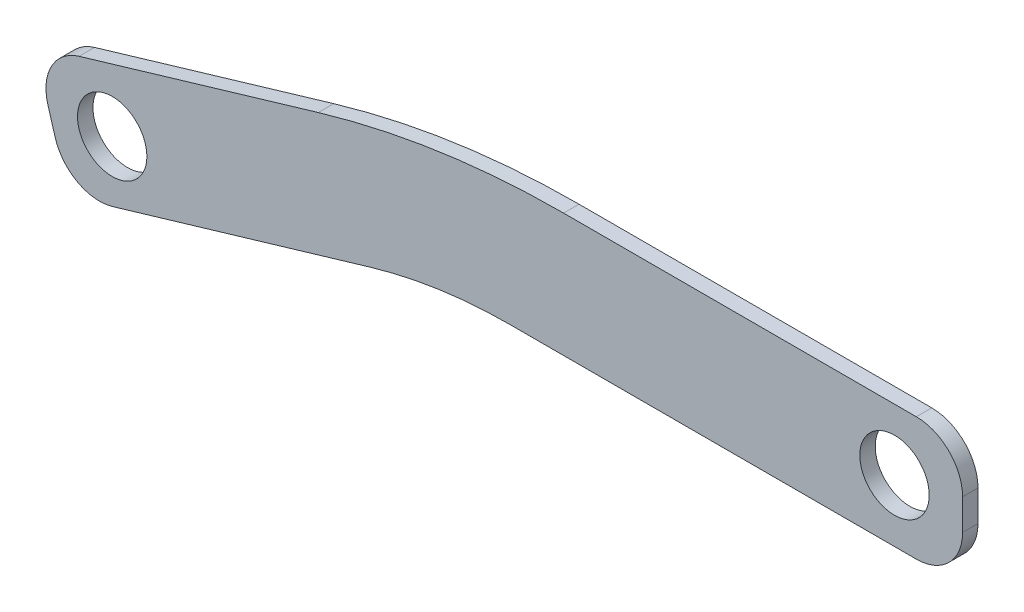
ISO-10303-21;
HEADER;
FILE_DESCRIPTION(('STEP AP214'),'2;1');
FILE_NAME('part.step','',(''),(''),'','','');
FILE_SCHEMA(('AUTOMOTIVE_DESIGN { 1 0 10303 214 1 1 1 1 }'));
ENDSEC;
DATA;
#1=APPLICATION_CONTEXT('core data for automotive mechanical design processes');
#2=APPLICATION_PROTOCOL_DEFINITION('international standard','automotive_design',2000,#1);
#3=PRODUCT_CONTEXT('',#1,'mechanical');
#4=PRODUCT('Part','Part','',(#3));
#5=PRODUCT_RELATED_PRODUCT_CATEGORY('part','',(#4));
#6=PRODUCT_DEFINITION_FORMATION('','',#4);
#7=PRODUCT_DEFINITION_CONTEXT('part definition',#1,'design');
#8=PRODUCT_DEFINITION('design','',#6,#7);
#9=PRODUCT_DEFINITION_SHAPE('','',#8);
#10=(LENGTH_UNIT() NAMED_UNIT(*) SI_UNIT(.MILLI.,.METRE.));
#11=(NAMED_UNIT(*) PLANE_ANGLE_UNIT() SI_UNIT($,.RADIAN.));
#12=(NAMED_UNIT(*) SI_UNIT($,.STERADIAN.) SOLID_ANGLE_UNIT());
#13=UNCERTAINTY_MEASURE_WITH_UNIT(LENGTH_MEASURE(1.E-05),#10,'distance_accuracy_value','');
#14=(GEOMETRIC_REPRESENTATION_CONTEXT(3) GLOBAL_UNCERTAINTY_ASSIGNED_CONTEXT((#13)) GLOBAL_UNIT_ASSIGNED_CONTEXT((#10,
#11,#12)) REPRESENTATION_CONTEXT('',''));
#15=CARTESIAN_POINT('',(0.,0.,0.));
#16=DIRECTION('',(0.,0.,1.));
#17=DIRECTION('',(1.,0.,0.));
#18=AXIS2_PLACEMENT_3D('',#15,#16,#17);
#19=CARTESIAN_POINT('',(0.,0.,6.35));
#20=DIRECTION('',(-0.284088329691374,0.958798112708387,0.));
#21=DIRECTION('',(-0.958798112708387,-0.284088329691374,0.));
#22=AXIS2_PLACEMENT_3D('',#19,#20,#21);
#23=PLANE('',#22);
#24=DIRECTION('',(0.958798112708387,0.284088329691374,0.));
#25=VECTOR('',#24,1.);
#26=CARTESIAN_POINT('',(0.,0.,6.35));
#27=LINE('',#26,#25);
#28=CARTESIAN_POINT('',(-134.134895952905,-39.7436728749349,6.35));
#29=VERTEX_POINT('',#28);
#30=CARTESIAN_POINT('',(-28.2562543045881,-8.37222349765574,6.35));
#31=VERTEX_POINT('',#30);
#32=EDGE_CURVE('E169',#29,#31,#27,.T.);
#33=ORIENTED_EDGE('',*,*,#32,.F.);
#34=DIRECTION('',(0.,0.,-1.));
#35=VECTOR('',#34,1.);
#36=CARTESIAN_POINT('',(-134.134895952905,-39.7436728749349,6.35));
#37=LINE('',#36,#35);
#38=CARTESIAN_POINT('',(-134.134895952905,-39.7436728749349,0.));
#39=VERTEX_POINT('',#38);
#40=EDGE_CURVE('E203',#29,#39,#37,.T.);
#41=ORIENTED_EDGE('',*,*,#40,.T.);
#42=DIRECTION('',(0.958798112708387,0.284088329691374,0.));
#43=VECTOR('',#42,1.);
#44=CARTESIAN_POINT('',(0.,0.,0.));
#45=LINE('',#44,#43);
#46=CARTESIAN_POINT('',(-28.2562543045881,-8.37222349765574,0.));
#47=VERTEX_POINT('',#46);
#48=EDGE_CURVE('E150',#39,#47,#45,.T.);
#49=ORIENTED_EDGE('',*,*,#48,.T.);
#50=DIRECTION('',(0.,0.,-1.));
#51=VECTOR('',#50,1.);
#52=CARTESIAN_POINT('',(-28.2562543045881,-8.37222349765576,6.35));
#53=LINE('',#52,#51);
#54=EDGE_CURVE('E136',#47,#31,#53,.F.);
#55=ORIENTED_EDGE('',*,*,#54,.T.);
#56=EDGE_LOOP('',(#33,#41,#49,#55));
#57=FACE_BOUND('',#56,.T.);
#58=ADVANCED_FACE('F39',(#57),#23,.F.);
#59=CARTESIAN_POINT('',(0.,0.,6.35));
#60=DIRECTION('',(0.,1.,0.));
#61=DIRECTION('',(0.,0.,1.));
#62=AXIS2_PLACEMENT_3D('',#59,#60,#61);
#63=PLANE('',#62);
#64=DIRECTION('',(1.,0.,0.));
#65=VECTOR('',#64,1.);
#66=CARTESIAN_POINT('',(0.,0.,0.));
#67=LINE('',#66,#65);
#68=CARTESIAN_POINT('',(29.4704942886991,0.,0.));
#69=VERTEX_POINT('',#68);
#70=CARTESIAN_POINT('',(196.85,0.,0.));
#71=VERTEX_POINT('',#70);
#72=EDGE_CURVE('E142',#69,#71,#67,.T.);
#73=ORIENTED_EDGE('',*,*,#72,.T.);
#74=DIRECTION('',(0.,0.,-1.));
#75=VECTOR('',#74,1.);
#76=CARTESIAN_POINT('',(196.85,0.,6.35));
#77=LINE('',#76,#75);
#78=CARTESIAN_POINT('',(196.85,0.,6.35));
#79=VERTEX_POINT('',#78);
#80=EDGE_CURVE('E48',#71,#79,#77,.F.);
#81=ORIENTED_EDGE('',*,*,#80,.T.);
#82=DIRECTION('',(1.,0.,0.));
#83=VECTOR('',#82,1.);
#84=CARTESIAN_POINT('',(0.,0.,6.35));
#85=LINE('',#84,#83);
#86=CARTESIAN_POINT('',(29.4704942886991,0.,6.35));
#87=VERTEX_POINT('',#86);
#88=EDGE_CURVE('E143',#87,#79,#85,.T.);
#89=ORIENTED_EDGE('',*,*,#88,.F.);
#90=DIRECTION('',(0.,0.,-1.));
#91=VECTOR('',#90,1.);
#92=CARTESIAN_POINT('',(29.4704942886991,0.,0.));
#93=LINE('',#92,#91);
#94=EDGE_CURVE('E134',#87,#69,#93,.T.);
#95=ORIENTED_EDGE('',*,*,#94,.T.);
#96=EDGE_LOOP('',(#73,#81,#89,#95));
#97=FACE_BOUND('',#96,.T.);
#98=ADVANCED_FACE('F141',(#97),#63,.F.);
#99=CARTESIAN_POINT('',(215.9,0.,6.35));
#100=DIRECTION('',(-1.,0.,0.));
#101=DIRECTION('',(0.,0.,1.));
#102=AXIS2_PLACEMENT_3D('',#99,#100,#101);
#103=PLANE('',#102);
#104=DIRECTION('',(0.,1.,0.));
#105=VECTOR('',#104,1.);
#106=CARTESIAN_POINT('',(215.9,0.,6.35));
#107=LINE('',#106,#105);
#108=CARTESIAN_POINT('',(215.9,19.05,6.35));
#109=VERTEX_POINT('',#108);
#110=CARTESIAN_POINT('',(215.9,31.75,6.35));
#111=VERTEX_POINT('',#110);
#112=EDGE_CURVE('E246',#109,#111,#107,.T.);
#113=ORIENTED_EDGE('',*,*,#112,.F.);
#114=DIRECTION('',(0.,0.,-1.));
#115=VECTOR('',#114,1.);
#116=CARTESIAN_POINT('',(215.9,19.05,6.35));
#117=LINE('',#116,#115);
#118=CARTESIAN_POINT('',(215.9,19.05,0.));
#119=VERTEX_POINT('',#118);
#120=EDGE_CURVE('E231',#109,#119,#117,.T.);
#121=ORIENTED_EDGE('',*,*,#120,.T.);
#122=DIRECTION('',(0.,1.,0.));
#123=VECTOR('',#122,1.);
#124=CARTESIAN_POINT('',(215.9,0.,0.));
#125=LINE('',#124,#123);
#126=CARTESIAN_POINT('',(215.9,31.75,0.));
#127=VERTEX_POINT('',#126);
#128=EDGE_CURVE('E149',#119,#127,#125,.T.);
#129=ORIENTED_EDGE('',*,*,#128,.T.);
#130=DIRECTION('',(0.,0.,-1.));
#131=VECTOR('',#130,1.);
#132=CARTESIAN_POINT('',(215.9,31.75,6.35));
#133=LINE('',#132,#131);
#134=EDGE_CURVE('E224',#127,#111,#133,.F.);
#135=ORIENTED_EDGE('',*,*,#134,.T.);
#136=EDGE_LOOP('',(#113,#121,#129,#135));
#137=FACE_BOUND('',#136,.T.);
#138=ADVANCED_FACE('F292',(#137),#103,.F.);
#139=CARTESIAN_POINT('',(215.9,50.8,6.35));
#140=DIRECTION('',(0.,-1.,0.));
#141=DIRECTION('',(1.,0.,0.));
#142=AXIS2_PLACEMENT_3D('',#139,#140,#141);
#143=PLANE('',#142);
#144=DIRECTION('',(-1.,0.,0.));
#145=VECTOR('',#144,1.);
#146=CARTESIAN_POINT('',(215.9,50.8,6.35));
#147=LINE('',#146,#145);
#148=CARTESIAN_POINT('',(196.85,50.8,6.35));
#149=VERTEX_POINT('',#148);
#150=CARTESIAN_POINT('',(51.5733650052233,50.8,6.35));
#151=VERTEX_POINT('',#150);
#152=EDGE_CURVE('E243',#149,#151,#147,.T.);
#153=ORIENTED_EDGE('',*,*,#152,.F.);
#154=DIRECTION('',(0.,0.,-1.));
#155=VECTOR('',#154,1.);
#156=CARTESIAN_POINT('',(196.85,50.8,6.35));
#157=LINE('',#156,#155);
#158=CARTESIAN_POINT('',(196.85,50.8,0.));
#159=VERTEX_POINT('',#158);
#160=EDGE_CURVE('E216',#149,#159,#157,.T.);
#161=ORIENTED_EDGE('',*,*,#160,.T.);
#162=DIRECTION('',(-1.,0.,0.));
#163=VECTOR('',#162,1.);
#164=CARTESIAN_POINT('',(215.9,50.8,0.));
#165=LINE('',#164,#163);
#166=CARTESIAN_POINT('',(51.5733650052233,50.8,0.));
#167=VERTEX_POINT('',#166);
#168=EDGE_CURVE('E154',#159,#167,#165,.T.);
#169=ORIENTED_EDGE('',*,*,#168,.T.);
#170=DIRECTION('',(0.,0.,-1.));
#171=VECTOR('',#170,1.);
#172=CARTESIAN_POINT('',(51.5733650052233,50.8,6.35));
#173=LINE('',#172,#171);
#174=EDGE_CURVE('E183',#167,#151,#173,.F.);
#175=ORIENTED_EDGE('',*,*,#174,.T.);
#176=EDGE_LOOP('',(#153,#161,#169,#175));
#177=FACE_BOUND('',#176,.T.);
#178=ADVANCED_FACE('F301',(#177),#143,.F.);
#179=CARTESIAN_POINT('',(0.,50.8,6.35));
#180=DIRECTION('',(0.284088329691374,-0.958798112708387,0.));
#181=DIRECTION('',(0.958798112708387,0.284088329691374,0.));
#182=AXIS2_PLACEMENT_3D('',#179,#180,#181);
#183=PLANE('',#182);
#184=DIRECTION('',(-0.958798112708387,-0.284088329691374,0.));
#185=VECTOR('',#184,1.);
#186=CARTESIAN_POINT('',(0.,50.8,0.));
#187=LINE('',#186,#185);
#188=CARTESIAN_POINT('',(-49.4484450330293,36.1486088791025,0.));
#189=VERTEX_POINT('',#188);
#190=CARTESIAN_POINT('',(-147.971970353914,6.95645322846994,0.));
#191=VERTEX_POINT('',#190);
#192=EDGE_CURVE('E162',#189,#191,#187,.T.);
#193=ORIENTED_EDGE('',*,*,#192,.T.);
#194=DIRECTION('',(0.,0.,-1.));
#195=VECTOR('',#194,1.);
#196=CARTESIAN_POINT('',(-147.971970353914,6.95645322846993,6.35));
#197=LINE('',#196,#195);
#198=CARTESIAN_POINT('',(-147.971970353914,6.95645322846994,6.35));
#199=VERTEX_POINT('',#198);
#200=EDGE_CURVE('E197',#191,#199,#197,.F.);
#201=ORIENTED_EDGE('',*,*,#200,.T.);
#202=DIRECTION('',(-0.958798112708387,-0.284088329691374,0.));
#203=VECTOR('',#202,1.);
#204=CARTESIAN_POINT('',(0.,50.8,6.35));
#205=LINE('',#204,#203);
#206=CARTESIAN_POINT('',(-49.4484450330293,36.1486088791025,6.35));
#207=VERTEX_POINT('',#206);
#208=EDGE_CURVE('E240',#207,#199,#205,.T.);
#209=ORIENTED_EDGE('',*,*,#208,.F.);
#210=DIRECTION('',(0.,0.,-1.));
#211=VECTOR('',#210,1.);
#212=CARTESIAN_POINT('',(-49.4484450330293,36.1486088791025,6.35));
#213=LINE('',#212,#211);
#214=EDGE_CURVE('E175',#207,#189,#213,.T.);
#215=ORIENTED_EDGE('',*,*,#214,.T.);
#216=EDGE_LOOP('',(#193,#201,#209,#215));
#217=FACE_BOUND('',#216,.T.);
#218=ADVANCED_FACE('F310',(#217),#183,.F.);
#219=CARTESIAN_POINT('',(-166.237074401009,1.54457054784925,6.35));
#220=DIRECTION('',(0.958798112708387,0.284088329691375,0.));
#221=DIRECTION('',(-0.284088329691375,0.958798112708387,0.));
#222=AXIS2_PLACEMENT_3D('',#219,#220,#221);
#223=PLANE('',#222);
#224=DIRECTION('',(0.284088329691375,-0.958798112708387,0.));
#225=VECTOR('',#224,1.);
#226=CARTESIAN_POINT('',(-166.237074401009,1.54457054784925,0.));
#227=LINE('',#226,#225);
#228=CARTESIAN_POINT('',(-160.825191720388,-16.7205334992455,0.));
#229=VERTEX_POINT('',#228);
#230=CARTESIAN_POINT('',(-157.811882680621,-26.8904515084608,0.));
#231=VERTEX_POINT('',#230);
#232=EDGE_CURVE('E166',#229,#231,#227,.T.);
#233=ORIENTED_EDGE('',*,*,#232,.T.);
#234=DIRECTION('',(0.,0.,-1.));
#235=VECTOR('',#234,1.);
#236=CARTESIAN_POINT('',(-157.811882680621,-26.8904515084608,6.35));
#237=LINE('',#236,#235);
#238=CARTESIAN_POINT('',(-157.811882680621,-26.8904515084608,6.35));
#239=VERTEX_POINT('',#238);
#240=EDGE_CURVE('E210',#231,#239,#237,.F.);
#241=ORIENTED_EDGE('',*,*,#240,.T.);
#242=DIRECTION('',(0.284088329691375,-0.958798112708387,0.));
#243=VECTOR('',#242,1.);
#244=CARTESIAN_POINT('',(-166.237074401009,1.54457054784925,6.35));
#245=LINE('',#244,#243);
#246=CARTESIAN_POINT('',(-160.825191720388,-16.7205334992455,6.35));
#247=VERTEX_POINT('',#246);
#248=EDGE_CURVE('E145',#247,#239,#245,.T.);
#249=ORIENTED_EDGE('',*,*,#248,.F.);
#250=DIRECTION('',(0.,0.,-1.));
#251=VECTOR('',#250,1.);
#252=CARTESIAN_POINT('',(-160.825191720388,-16.7205334992455,6.35));
#253=LINE('',#252,#251);
#254=EDGE_CURVE('E190',#247,#229,#253,.T.);
#255=ORIENTED_EDGE('',*,*,#254,.T.);
#256=EDGE_LOOP('',(#233,#241,#249,#255));
#257=FACE_BOUND('',#256,.T.);
#258=ADVANCED_FACE('F284',(#257),#223,.F.);
#259=CARTESIAN_POINT('',(0.,0.,6.35));
#260=DIRECTION('',(0.,0.,1.));
#261=DIRECTION('',(1.,0.,0.));
#262=AXIS2_PLACEMENT_3D('',#259,#260,#261);
#263=PLANE('',#262);
#264=CARTESIAN_POINT('',(-134.33022137999,-14.825444285993,6.35));
#265=DIRECTION('',(0.,0.,1.));
#266=DIRECTION('',(1.,0.,0.));
#267=AXIS2_PLACEMENT_3D('',#264,#265,#266);
#268=CIRCLE('',#267,14.2875);
#269=CARTESIAN_POINT('',(-120.04272137999,-14.825444285993,6.35));
#270=VERTEX_POINT('',#269);
#271=EDGE_CURVE('E264',#270,#270,#268,.T.);
#272=ORIENTED_EDGE('',*,*,#271,.F.);
#273=EDGE_LOOP('',(#272));
#274=FACE_BOUND('',#273,.T.);
#275=CARTESIAN_POINT('',(187.85890106728,25.4485206278545,6.35));
#276=DIRECTION('',(0.,0.,1.));
#277=DIRECTION('',(1.,0.,0.));
#278=AXIS2_PLACEMENT_3D('',#275,#276,#277);
#279=CIRCLE('',#278,14.2875);
#280=CARTESIAN_POINT('',(202.14640106728,25.4485206278545,6.35));
#281=VERTEX_POINT('',#280);
#282=EDGE_CURVE('E256',#281,#281,#279,.T.);
#283=ORIENTED_EDGE('',*,*,#282,.F.);
#284=EDGE_LOOP('',(#283));
#285=FACE_BOUND('',#284,.T.);
#286=ORIENTED_EDGE('',*,*,#88,.T.);
#287=CARTESIAN_POINT('',(196.85,19.05,6.35));
#288=DIRECTION('',(0.,0.,1.));
#289=DIRECTION('',(1.,0.,0.));
#290=AXIS2_PLACEMENT_3D('',#287,#288,#289);
#291=CIRCLE('',#290,19.05);
#292=EDGE_CURVE('E11',#79,#109,#291,.T.);
#293=ORIENTED_EDGE('',*,*,#292,.T.);
#294=ORIENTED_EDGE('',*,*,#112,.T.);
#295=CARTESIAN_POINT('',(196.85,31.75,6.35));
#296=DIRECTION('',(0.,0.,1.));
#297=DIRECTION('',(1.,0.,0.));
#298=AXIS2_PLACEMENT_3D('',#295,#296,#297);
#299=CIRCLE('',#298,19.05);
#300=EDGE_CURVE('E228',#111,#149,#299,.T.);
#301=ORIENTED_EDGE('',*,*,#300,.T.);
#302=ORIENTED_EDGE('',*,*,#152,.T.);
#303=CARTESIAN_POINT('',(51.5733650052233,-304.8,6.35));
#304=DIRECTION('',(0.,0.,1.));
#305=DIRECTION('',(1.,0.,0.));
#306=AXIS2_PLACEMENT_3D('',#303,#304,#305);
#307=CIRCLE('',#306,355.6);
#308=EDGE_CURVE('E187',#151,#207,#307,.T.);
#309=ORIENTED_EDGE('',*,*,#308,.T.);
#310=ORIENTED_EDGE('',*,*,#208,.T.);
#311=CARTESIAN_POINT('',(-142.560087673293,-11.3086508186248,6.35));
#312=DIRECTION('',(0.,0.,1.));
#313=DIRECTION('',(1.,0.,0.));
#314=AXIS2_PLACEMENT_3D('',#311,#312,#313);
#315=CIRCLE('',#314,19.05);
#316=EDGE_CURVE('E200',#199,#247,#315,.T.);
#317=ORIENTED_EDGE('',*,*,#316,.T.);
#318=ORIENTED_EDGE('',*,*,#248,.T.);
#319=CARTESIAN_POINT('',(-139.546778633526,-21.4785688278401,6.35));
#320=DIRECTION('',(0.,0.,1.));
#321=DIRECTION('',(1.,0.,0.));
#322=AXIS2_PLACEMENT_3D('',#319,#320,#321);
#323=CIRCLE('',#322,19.05);
#324=EDGE_CURVE('E213',#239,#29,#323,.T.);
#325=ORIENTED_EDGE('',*,*,#324,.T.);
#326=ORIENTED_EDGE('',*,*,#32,.T.);
#327=CARTESIAN_POINT('',(29.4704942886991,-203.2,6.35));
#328=DIRECTION('',(0.,0.,1.));
#329=DIRECTION('',(1.,0.,0.));
#330=AXIS2_PLACEMENT_3D('',#327,#328,#329);
#331=CIRCLE('',#330,203.2);
#332=EDGE_CURVE('E139',#31,#87,#331,.F.);
#333=ORIENTED_EDGE('',*,*,#332,.T.);
#334=EDGE_LOOP('',(#286,#293,#294,#301,#302,#309,#310,#317,#318,#325,#326,#333));
#335=FACE_BOUND('',#334,.T.);
#336=ADVANCED_FACE('F281',(#274,#285,#335),#263,.T.);
#337=CARTESIAN_POINT('',(0.,0.,0.));
#338=DIRECTION('',(0.,0.,1.));
#339=DIRECTION('',(1.,0.,0.));
#340=AXIS2_PLACEMENT_3D('',#337,#338,#339);
#341=PLANE('',#340);
#342=CARTESIAN_POINT('',(-134.33022137999,-14.825444285993,0.));
#343=DIRECTION('',(0.,0.,1.));
#344=DIRECTION('',(1.,0.,0.));
#345=AXIS2_PLACEMENT_3D('',#342,#343,#344);
#346=CIRCLE('',#345,14.2875);
#347=CARTESIAN_POINT('',(-120.04272137999,-14.825444285993,0.));
#348=VERTEX_POINT('',#347);
#349=EDGE_CURVE('E156',#348,#348,#346,.T.);
#350=ORIENTED_EDGE('',*,*,#349,.T.);
#351=EDGE_LOOP('',(#350));
#352=FACE_BOUND('',#351,.T.);
#353=CARTESIAN_POINT('',(187.85890106728,25.4485206278545,0.));
#354=DIRECTION('',(0.,0.,1.));
#355=DIRECTION('',(1.,0.,0.));
#356=AXIS2_PLACEMENT_3D('',#353,#354,#355);
#357=CIRCLE('',#356,14.2875);
#358=CARTESIAN_POINT('',(202.14640106728,25.4485206278545,0.));
#359=VERTEX_POINT('',#358);
#360=EDGE_CURVE('E260',#359,#359,#357,.T.);
#361=ORIENTED_EDGE('',*,*,#360,.T.);
#362=EDGE_LOOP('',(#361));
#363=FACE_BOUND('',#362,.T.);
#364=ORIENTED_EDGE('',*,*,#128,.F.);
#365=CARTESIAN_POINT('',(196.85,19.05,0.));
#366=DIRECTION('',(0.,0.,1.));
#367=DIRECTION('',(1.,0.,0.));
#368=AXIS2_PLACEMENT_3D('',#365,#366,#367);
#369=CIRCLE('',#368,19.05);
#370=EDGE_CURVE('E62',#119,#71,#369,.F.);
#371=ORIENTED_EDGE('',*,*,#370,.T.);
#372=ORIENTED_EDGE('',*,*,#72,.F.);
#373=CARTESIAN_POINT('',(29.4704942886991,-203.2,0.));
#374=DIRECTION('',(0.,0.,1.));
#375=DIRECTION('',(1.,0.,0.));
#376=AXIS2_PLACEMENT_3D('',#373,#374,#375);
#377=CIRCLE('',#376,203.2);
#378=EDGE_CURVE('E130',#69,#47,#377,.T.);
#379=ORIENTED_EDGE('',*,*,#378,.T.);
#380=ORIENTED_EDGE('',*,*,#48,.F.);
#381=CARTESIAN_POINT('',(-139.546778633526,-21.4785688278401,0.));
#382=DIRECTION('',(0.,0.,1.));
#383=DIRECTION('',(1.,0.,0.));
#384=AXIS2_PLACEMENT_3D('',#381,#382,#383);
#385=CIRCLE('',#384,19.05);
#386=EDGE_CURVE('E207',#39,#231,#385,.F.);
#387=ORIENTED_EDGE('',*,*,#386,.T.);
#388=ORIENTED_EDGE('',*,*,#232,.F.);
#389=CARTESIAN_POINT('',(-142.560087673293,-11.3086508186248,0.));
#390=DIRECTION('',(0.,0.,1.));
#391=DIRECTION('',(1.,0.,0.));
#392=AXIS2_PLACEMENT_3D('',#389,#390,#391);
#393=CIRCLE('',#392,19.05);
#394=EDGE_CURVE('E194',#229,#191,#393,.F.);
#395=ORIENTED_EDGE('',*,*,#394,.T.);
#396=ORIENTED_EDGE('',*,*,#192,.F.);
#397=CARTESIAN_POINT('',(51.5733650052233,-304.8,0.));
#398=DIRECTION('',(0.,0.,1.));
#399=DIRECTION('',(1.,0.,0.));
#400=AXIS2_PLACEMENT_3D('',#397,#398,#399);
#401=CIRCLE('',#400,355.6);
#402=EDGE_CURVE('E179',#189,#167,#401,.F.);
#403=ORIENTED_EDGE('',*,*,#402,.T.);
#404=ORIENTED_EDGE('',*,*,#168,.F.);
#405=CARTESIAN_POINT('',(196.85,31.75,0.));
#406=DIRECTION('',(0.,0.,1.));
#407=DIRECTION('',(1.,0.,0.));
#408=AXIS2_PLACEMENT_3D('',#405,#406,#407);
#409=CIRCLE('',#408,19.05);
#410=EDGE_CURVE('E220',#159,#127,#409,.F.);
#411=ORIENTED_EDGE('',*,*,#410,.T.);
#412=EDGE_LOOP('',(#364,#371,#372,#379,#380,#387,#388,#395,#396,#403,#404,#411));
#413=FACE_BOUND('',#412,.T.);
#414=ADVANCED_FACE('F147',(#352,#363,#413),#341,.F.);
#415=CARTESIAN_POINT('',(29.4704942886991,-203.2,6.35));
#416=DIRECTION('',(0.,0.,1.));
#417=DIRECTION('',(1.,0.,0.));
#418=AXIS2_PLACEMENT_3D('',#415,#416,#417);
#419=CYLINDRICAL_SURFACE('',#418,203.2);
#420=ORIENTED_EDGE('',*,*,#332,.F.);
#421=ORIENTED_EDGE('',*,*,#54,.F.);
#422=ORIENTED_EDGE('',*,*,#378,.F.);
#423=ORIENTED_EDGE('',*,*,#94,.F.);
#424=EDGE_LOOP('',(#420,#421,#422,#423));
#425=FACE_BOUND('',#424,.T.);
#426=ADVANCED_FACE('F133',(#425),#419,.F.);
#427=CARTESIAN_POINT('',(51.5733650052233,-304.8,6.35));
#428=DIRECTION('',(0.,0.,-1.));
#429=DIRECTION('',(-1.,0.,0.));
#430=AXIS2_PLACEMENT_3D('',#427,#428,#429);
#431=CYLINDRICAL_SURFACE('',#430,355.6);
#432=ORIENTED_EDGE('',*,*,#308,.F.);
#433=ORIENTED_EDGE('',*,*,#174,.F.);
#434=ORIENTED_EDGE('',*,*,#402,.F.);
#435=ORIENTED_EDGE('',*,*,#214,.F.);
#436=EDGE_LOOP('',(#432,#433,#434,#435));
#437=FACE_BOUND('',#436,.T.);
#438=ADVANCED_FACE('F306',(#437),#431,.T.);
#439=CARTESIAN_POINT('',(-142.560087673293,-11.3086508186248,6.35));
#440=DIRECTION('',(0.,0.,-1.));
#441=DIRECTION('',(-1.,0.,0.));
#442=AXIS2_PLACEMENT_3D('',#439,#440,#441);
#443=CYLINDRICAL_SURFACE('',#442,19.05);
#444=ORIENTED_EDGE('',*,*,#316,.F.);
#445=ORIENTED_EDGE('',*,*,#200,.F.);
#446=ORIENTED_EDGE('',*,*,#394,.F.);
#447=ORIENTED_EDGE('',*,*,#254,.F.);
#448=EDGE_LOOP('',(#444,#445,#446,#447));
#449=FACE_BOUND('',#448,.T.);
#450=ADVANCED_FACE('F314',(#449),#443,.T.);
#451=CARTESIAN_POINT('',(-139.546778633526,-21.4785688278401,6.35));
#452=DIRECTION('',(0.,0.,-1.));
#453=DIRECTION('',(-1.,0.,0.));
#454=AXIS2_PLACEMENT_3D('',#451,#452,#453);
#455=CYLINDRICAL_SURFACE('',#454,19.05);
#456=ORIENTED_EDGE('',*,*,#324,.F.);
#457=ORIENTED_EDGE('',*,*,#240,.F.);
#458=ORIENTED_EDGE('',*,*,#386,.F.);
#459=ORIENTED_EDGE('',*,*,#40,.F.);
#460=EDGE_LOOP('',(#456,#457,#458,#459));
#461=FACE_BOUND('',#460,.T.);
#462=ADVANCED_FACE('F322',(#461),#455,.T.);
#463=CARTESIAN_POINT('',(196.85,31.75,6.35));
#464=DIRECTION('',(0.,0.,-1.));
#465=DIRECTION('',(-1.,0.,0.));
#466=AXIS2_PLACEMENT_3D('',#463,#464,#465);
#467=CYLINDRICAL_SURFACE('',#466,19.05);
#468=ORIENTED_EDGE('',*,*,#300,.F.);
#469=ORIENTED_EDGE('',*,*,#134,.F.);
#470=ORIENTED_EDGE('',*,*,#410,.F.);
#471=ORIENTED_EDGE('',*,*,#160,.F.);
#472=EDGE_LOOP('',(#468,#469,#470,#471));
#473=FACE_BOUND('',#472,.T.);
#474=ADVANCED_FACE('F298',(#473),#467,.T.);
#475=CARTESIAN_POINT('',(196.85,19.05,6.35));
#476=DIRECTION('',(0.,0.,-1.));
#477=DIRECTION('',(-1.,0.,0.));
#478=AXIS2_PLACEMENT_3D('',#475,#476,#477);
#479=CYLINDRICAL_SURFACE('',#478,19.05);
#480=ORIENTED_EDGE('',*,*,#292,.F.);
#481=ORIENTED_EDGE('',*,*,#80,.F.);
#482=ORIENTED_EDGE('',*,*,#370,.F.);
#483=ORIENTED_EDGE('',*,*,#120,.F.);
#484=EDGE_LOOP('',(#480,#481,#482,#483));
#485=FACE_BOUND('',#484,.T.);
#486=ADVANCED_FACE('F41',(#485),#479,.T.);
#487=CARTESIAN_POINT('',(187.85890106728,25.4485206278545,0.));
#488=DIRECTION('',(0.,0.,1.));
#489=DIRECTION('',(1.,0.,0.));
#490=AXIS2_PLACEMENT_3D('',#487,#488,#489);
#491=CYLINDRICAL_SURFACE('',#490,14.2875);
#492=ORIENTED_EDGE('',*,*,#360,.F.);
#493=EDGE_LOOP('',(#492));
#494=FACE_BOUND('',#493,.T.);
#495=ORIENTED_EDGE('',*,*,#282,.T.);
#496=EDGE_LOOP('',(#495));
#497=FACE_BOUND('',#496,.T.);
#498=ADVANCED_FACE('F277',(#494,#497),#491,.F.);
#499=CARTESIAN_POINT('',(-134.33022137999,-14.825444285993,0.));
#500=DIRECTION('',(0.,0.,1.));
#501=DIRECTION('',(1.,0.,0.));
#502=AXIS2_PLACEMENT_3D('',#499,#500,#501);
#503=CYLINDRICAL_SURFACE('',#502,14.2875);
#504=ORIENTED_EDGE('',*,*,#349,.F.);
#505=EDGE_LOOP('',(#504));
#506=FACE_BOUND('',#505,.T.);
#507=ORIENTED_EDGE('',*,*,#271,.T.);
#508=EDGE_LOOP('',(#507));
#509=FACE_BOUND('',#508,.T.);
#510=ADVANCED_FACE('F274',(#506,#509),#503,.F.);
#511=CLOSED_SHELL('',(#58,#98,#138,#178,#218,#258,#336,#414,#426,#438,#450,#462,#474,#486,#498,#510));
#512=MANIFOLD_SOLID_BREP('B2',#511);
#513=ADVANCED_BREP_SHAPE_REPRESENTATION('',(#18,#512),#14);
#514=SHAPE_DEFINITION_REPRESENTATION(#9,#513);
ENDSEC;
END-ISO-10303-21;
